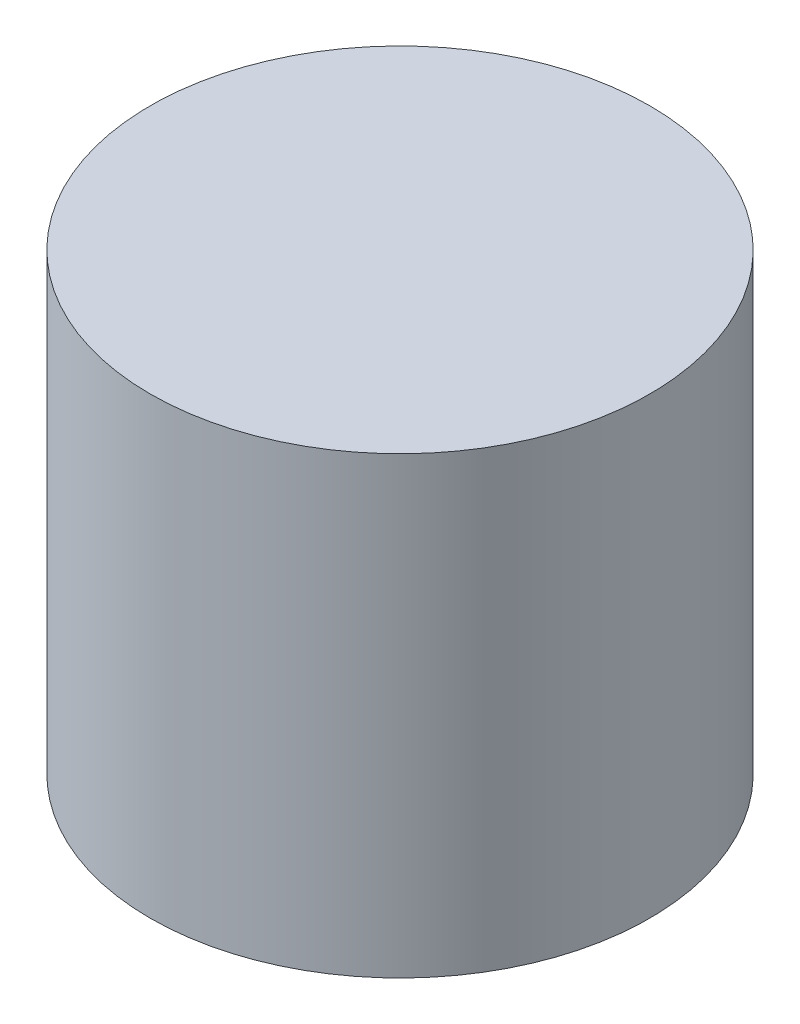
ISO-10303-21;
HEADER;
FILE_DESCRIPTION(('STEP AP214'),'2;1');
FILE_NAME('part.step','',(''),(''),'','','');
FILE_SCHEMA(('AUTOMOTIVE_DESIGN { 1 0 10303 214 1 1 1 1 }'));
ENDSEC;
DATA;
#1=APPLICATION_CONTEXT('core data for automotive mechanical design processes');
#2=APPLICATION_PROTOCOL_DEFINITION('international standard','automotive_design',2000,#1);
#3=PRODUCT_CONTEXT('',#1,'mechanical');
#4=PRODUCT('Part','Part','',(#3));
#5=PRODUCT_RELATED_PRODUCT_CATEGORY('part','',(#4));
#6=PRODUCT_DEFINITION_FORMATION('','',#4);
#7=PRODUCT_DEFINITION_CONTEXT('part definition',#1,'design');
#8=PRODUCT_DEFINITION('design','',#6,#7);
#9=PRODUCT_DEFINITION_SHAPE('','',#8);
#10=(LENGTH_UNIT() NAMED_UNIT(*) SI_UNIT(.MILLI.,.METRE.));
#11=(NAMED_UNIT(*) PLANE_ANGLE_UNIT() SI_UNIT($,.RADIAN.));
#12=(NAMED_UNIT(*) SI_UNIT($,.STERADIAN.) SOLID_ANGLE_UNIT());
#13=UNCERTAINTY_MEASURE_WITH_UNIT(LENGTH_MEASURE(1.E-05),#10,'distance_accuracy_value','');
#14=(GEOMETRIC_REPRESENTATION_CONTEXT(3) GLOBAL_UNCERTAINTY_ASSIGNED_CONTEXT((#13)) GLOBAL_UNIT_ASSIGNED_CONTEXT((#10,
#11,#12)) REPRESENTATION_CONTEXT('',''));
#15=CARTESIAN_POINT('',(0.,0.,0.));
#16=DIRECTION('',(0.,0.,1.));
#17=DIRECTION('',(1.,0.,0.));
#18=AXIS2_PLACEMENT_3D('',#15,#16,#17);
#19=CARTESIAN_POINT('',(0.,127.,0.));
#20=DIRECTION('',(0.,-1.,0.));
#21=DIRECTION('',(0.,0.,-1.));
#22=AXIS2_PLACEMENT_3D('',#19,#20,#21);
#23=CYLINDRICAL_SURFACE('',#22,69.85);
#24=CARTESIAN_POINT('',(0.,127.,0.));
#25=DIRECTION('',(0.,1.,0.));
#26=DIRECTION('',(0.,0.,1.));
#27=AXIS2_PLACEMENT_3D('',#24,#25,#26);
#28=CIRCLE('',#27,69.85);
#29=CARTESIAN_POINT('',(0.,127.,69.85));
#30=VERTEX_POINT('',#29);
#31=EDGE_CURVE('E10',#30,#30,#28,.T.);
#32=ORIENTED_EDGE('',*,*,#31,.F.);
#33=EDGE_LOOP('',(#32));
#34=FACE_BOUND('',#33,.T.);
#35=CARTESIAN_POINT('',(0.,0.,0.));
#36=DIRECTION('',(0.,1.,0.));
#37=DIRECTION('',(0.,0.,1.));
#38=AXIS2_PLACEMENT_3D('',#35,#36,#37);
#39=CIRCLE('',#38,69.85);
#40=CARTESIAN_POINT('',(0.,0.,69.85));
#41=VERTEX_POINT('',#40);
#42=EDGE_CURVE('E34',#41,#41,#39,.T.);
#43=ORIENTED_EDGE('',*,*,#42,.T.);
#44=EDGE_LOOP('',(#43));
#45=FACE_BOUND('',#44,.T.);
#46=ADVANCED_FACE('F31',(#34,#45),#23,.T.);
#47=CARTESIAN_POINT('',(0.,127.,0.));
#48=DIRECTION('',(0.,1.,0.));
#49=DIRECTION('',(0.,0.,1.));
#50=AXIS2_PLACEMENT_3D('',#47,#48,#49);
#51=PLANE('',#50);
#52=ORIENTED_EDGE('',*,*,#31,.T.);
#53=EDGE_LOOP('',(#52));
#54=FACE_BOUND('',#53,.T.);
#55=ADVANCED_FACE('F46',(#54),#51,.T.);
#56=CARTESIAN_POINT('',(0.,0.,0.));
#57=DIRECTION('',(0.,1.,0.));
#58=DIRECTION('',(0.,0.,1.));
#59=AXIS2_PLACEMENT_3D('',#56,#57,#58);
#60=PLANE('',#59);
#61=ORIENTED_EDGE('',*,*,#42,.F.);
#62=EDGE_LOOP('',(#61));
#63=FACE_BOUND('',#62,.T.);
#64=ADVANCED_FACE('F44',(#63),#60,.F.);
#65=CLOSED_SHELL('',(#46,#55,#64));
#66=MANIFOLD_SOLID_BREP('B2',#65);
#67=ADVANCED_BREP_SHAPE_REPRESENTATION('',(#18,#66),#14);
#68=SHAPE_DEFINITION_REPRESENTATION(#9,#67);
ENDSEC;
END-ISO-10303-21;
